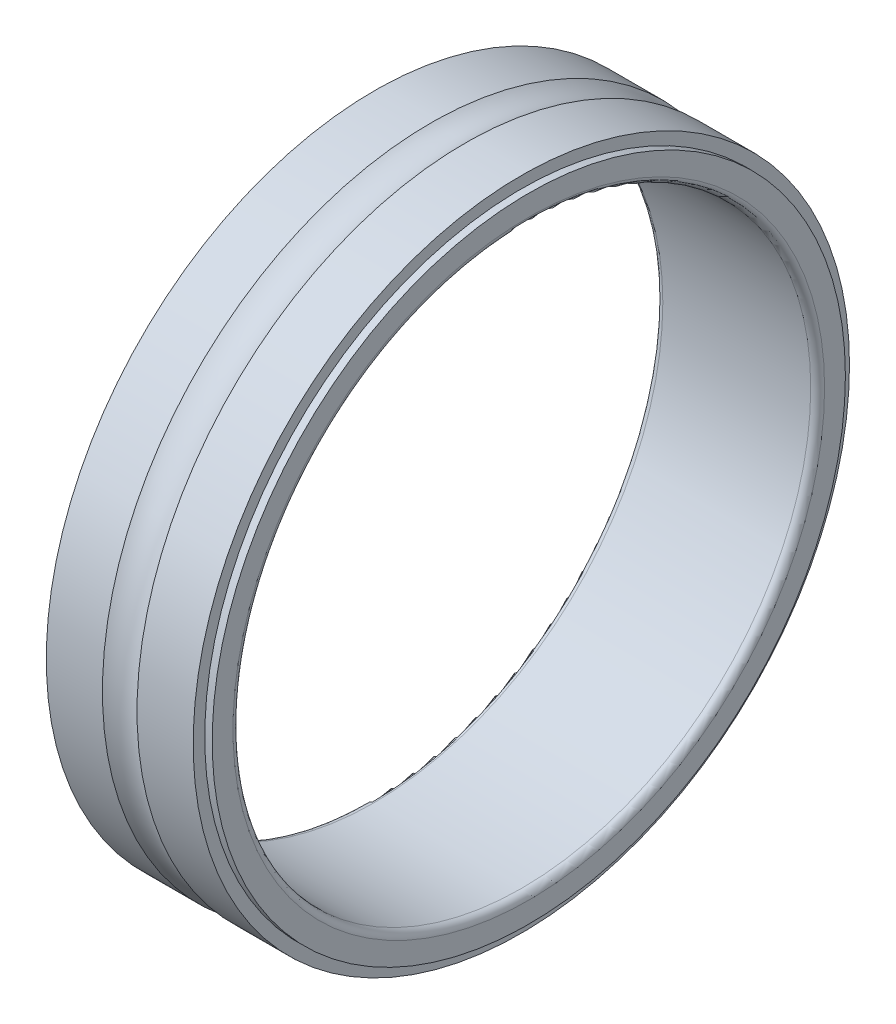
ISO-10303-21;
HEADER;
FILE_DESCRIPTION(('STEP AP214'),'2;1');
FILE_NAME('part.step','',(''),(''),'','','');
FILE_SCHEMA(('AUTOMOTIVE_DESIGN { 1 0 10303 214 1 1 1 1 }'));
ENDSEC;
DATA;
#1=APPLICATION_CONTEXT('core data for automotive mechanical design processes');
#2=APPLICATION_PROTOCOL_DEFINITION('international standard','automotive_design',2000,#1);
#3=PRODUCT_CONTEXT('',#1,'mechanical');
#4=PRODUCT('Part','Part','',(#3));
#5=PRODUCT_RELATED_PRODUCT_CATEGORY('part','',(#4));
#6=PRODUCT_DEFINITION_FORMATION('','',#4);
#7=PRODUCT_DEFINITION_CONTEXT('part definition',#1,'design');
#8=PRODUCT_DEFINITION('design','',#6,#7);
#9=PRODUCT_DEFINITION_SHAPE('','',#8);
#10=(LENGTH_UNIT() NAMED_UNIT(*) SI_UNIT(.MILLI.,.METRE.));
#11=(NAMED_UNIT(*) PLANE_ANGLE_UNIT() SI_UNIT($,.RADIAN.));
#12=(NAMED_UNIT(*) SI_UNIT($,.STERADIAN.) SOLID_ANGLE_UNIT());
#13=UNCERTAINTY_MEASURE_WITH_UNIT(LENGTH_MEASURE(1.E-05),#10,'distance_accuracy_value','');
#14=(GEOMETRIC_REPRESENTATION_CONTEXT(3) GLOBAL_UNCERTAINTY_ASSIGNED_CONTEXT((#13)) GLOBAL_UNIT_ASSIGNED_CONTEXT((#10,
#11,#12)) REPRESENTATION_CONTEXT('',''));
#15=CARTESIAN_POINT('',(0.,0.,0.));
#16=DIRECTION('',(0.,0.,1.));
#17=DIRECTION('',(1.,0.,0.));
#18=AXIS2_PLACEMENT_3D('',#15,#16,#17);
#19=CARTESIAN_POINT('',(7.,0.,0.));
#20=DIRECTION('',(1.,0.,0.));
#21=DIRECTION('',(0.,0.,-1.));
#22=AXIS2_PLACEMENT_3D('',#19,#20,#21);
#23=CYLINDRICAL_SURFACE('',#22,13.7);
#24=CARTESIAN_POINT('',(0.322,0.,0.));
#25=DIRECTION('',(1.,0.,0.));
#26=DIRECTION('',(0.,0.,-1.));
#27=AXIS2_PLACEMENT_3D('',#24,#25,#26);
#28=CIRCLE('',#27,13.7);
#29=CARTESIAN_POINT('',(0.322,0.,-13.7));
#30=VERTEX_POINT('',#29);
#31=EDGE_CURVE('E11',#30,#30,#28,.T.);
#32=ORIENTED_EDGE('',*,*,#31,.F.);
#33=EDGE_LOOP('',(#32));
#34=FACE_BOUND('',#33,.T.);
#35=CARTESIAN_POINT('',(0.,0.,0.));
#36=DIRECTION('',(1.,0.,0.));
#37=DIRECTION('',(0.,0.,-1.));
#38=AXIS2_PLACEMENT_3D('',#35,#36,#37);
#39=CIRCLE('',#38,13.7);
#40=CARTESIAN_POINT('',(0.,0.,-13.7));
#41=VERTEX_POINT('',#40);
#42=EDGE_CURVE('E82',#41,#41,#39,.T.);
#43=ORIENTED_EDGE('',*,*,#42,.T.);
#44=EDGE_LOOP('',(#43));
#45=FACE_BOUND('',#44,.T.);
#46=ADVANCED_FACE('F16',(#34,#45),#23,.T.);
#47=CARTESIAN_POINT('',(0.322,14.2,0.));
#48=DIRECTION('',(-1.,0.,0.));
#49=DIRECTION('',(0.,0.,1.));
#50=AXIS2_PLACEMENT_3D('',#47,#48,#49);
#51=PLANE('',#50);
#52=CARTESIAN_POINT('',(0.322,0.,0.));
#53=DIRECTION('',(1.,0.,0.));
#54=DIRECTION('',(0.,0.,-1.));
#55=AXIS2_PLACEMENT_3D('',#52,#53,#54);
#56=CIRCLE('',#55,14.2);
#57=CARTESIAN_POINT('',(0.322,0.,-14.2));
#58=VERTEX_POINT('',#57);
#59=EDGE_CURVE('E27',#58,#58,#56,.T.);
#60=ORIENTED_EDGE('',*,*,#59,.F.);
#61=EDGE_LOOP('',(#60));
#62=FACE_BOUND('',#61,.T.);
#63=ORIENTED_EDGE('',*,*,#31,.T.);
#64=EDGE_LOOP('',(#63));
#65=FACE_BOUND('',#64,.T.);
#66=ADVANCED_FACE('F206',(#62,#65),#51,.T.);
#67=CARTESIAN_POINT('',(7.,0.,0.));
#68=DIRECTION('',(1.,0.,0.));
#69=DIRECTION('',(0.,0.,-1.));
#70=AXIS2_PLACEMENT_3D('',#67,#68,#69);
#71=CYLINDRICAL_SURFACE('',#70,14.2);
#72=CARTESIAN_POINT('',(2.75166852264521,0.,0.));
#73=DIRECTION('',(1.,0.,0.));
#74=DIRECTION('',(0.,0.,-1.));
#75=AXIS2_PLACEMENT_3D('',#72,#73,#74);
#76=CIRCLE('',#75,14.2);
#77=CARTESIAN_POINT('',(2.75166852264521,0.,-14.2));
#78=VERTEX_POINT('',#77);
#79=EDGE_CURVE('E117',#78,#78,#76,.T.);
#80=ORIENTED_EDGE('',*,*,#79,.F.);
#81=EDGE_LOOP('',(#80));
#82=FACE_BOUND('',#81,.T.);
#83=ORIENTED_EDGE('',*,*,#59,.T.);
#84=EDGE_LOOP('',(#83));
#85=FACE_BOUND('',#84,.T.);
#86=ADVANCED_FACE('F183',(#82,#85),#71,.T.);
#87=CARTESIAN_POINT('',(3.5,0.,0.));
#88=DIRECTION('',(1.,0.,0.));
#89=DIRECTION('',(0.,0.,-1.));
#90=AXIS2_PLACEMENT_3D('',#87,#88,#89);
#91=TOROIDAL_SURFACE('',#90,15.5,1.5);
#92=ORIENTED_EDGE('',*,*,#79,.T.);
#93=EDGE_LOOP('',(#92));
#94=FACE_BOUND('',#93,.T.);
#95=CARTESIAN_POINT('',(4.24833147735479,0.,0.));
#96=DIRECTION('',(1.,0.,0.));
#97=DIRECTION('',(0.,0.,-1.));
#98=AXIS2_PLACEMENT_3D('',#95,#96,#97);
#99=CIRCLE('',#98,14.2);
#100=CARTESIAN_POINT('',(4.24833147735479,0.,-14.2));
#101=VERTEX_POINT('',#100);
#102=EDGE_CURVE('E48',#101,#101,#99,.T.);
#103=ORIENTED_EDGE('',*,*,#102,.F.);
#104=EDGE_LOOP('',(#103));
#105=FACE_BOUND('',#104,.T.);
#106=ADVANCED_FACE('F178',(#94,#105),#91,.F.);
#107=CARTESIAN_POINT('',(7.,0.,0.));
#108=DIRECTION('',(1.,0.,0.));
#109=DIRECTION('',(0.,0.,-1.));
#110=AXIS2_PLACEMENT_3D('',#107,#108,#109);
#111=CYLINDRICAL_SURFACE('',#110,14.2);
#112=CARTESIAN_POINT('',(6.678,0.,0.));
#113=DIRECTION('',(1.,0.,0.));
#114=DIRECTION('',(0.,0.,-1.));
#115=AXIS2_PLACEMENT_3D('',#112,#113,#114);
#116=CIRCLE('',#115,14.2);
#117=CARTESIAN_POINT('',(6.678,0.,-14.2));
#118=VERTEX_POINT('',#117);
#119=EDGE_CURVE('E59',#118,#118,#116,.T.);
#120=ORIENTED_EDGE('',*,*,#119,.F.);
#121=EDGE_LOOP('',(#120));
#122=FACE_BOUND('',#121,.T.);
#123=ORIENTED_EDGE('',*,*,#102,.T.);
#124=EDGE_LOOP('',(#123));
#125=FACE_BOUND('',#124,.T.);
#126=ADVANCED_FACE('F18',(#122,#125),#111,.T.);
#127=CARTESIAN_POINT('',(6.678,13.7,0.));
#128=DIRECTION('',(1.,0.,0.));
#129=DIRECTION('',(0.,1.,0.));
#130=AXIS2_PLACEMENT_3D('',#127,#128,#129);
#131=PLANE('',#130);
#132=CARTESIAN_POINT('',(6.678,0.,0.));
#133=DIRECTION('',(1.,0.,0.));
#134=DIRECTION('',(0.,0.,-1.));
#135=AXIS2_PLACEMENT_3D('',#132,#133,#134);
#136=CIRCLE('',#135,13.7);
#137=CARTESIAN_POINT('',(6.678,0.,-13.7));
#138=VERTEX_POINT('',#137);
#139=EDGE_CURVE('E20',#138,#138,#136,.T.);
#140=ORIENTED_EDGE('',*,*,#139,.F.);
#141=EDGE_LOOP('',(#140));
#142=FACE_BOUND('',#141,.T.);
#143=ORIENTED_EDGE('',*,*,#119,.T.);
#144=EDGE_LOOP('',(#143));
#145=FACE_BOUND('',#144,.T.);
#146=ADVANCED_FACE('F157',(#142,#145),#131,.T.);
#147=CARTESIAN_POINT('',(7.,0.,0.));
#148=DIRECTION('',(1.,0.,0.));
#149=DIRECTION('',(0.,0.,-1.));
#150=AXIS2_PLACEMENT_3D('',#147,#148,#149);
#151=CYLINDRICAL_SURFACE('',#150,13.7);
#152=CARTESIAN_POINT('',(7.,0.,0.));
#153=DIRECTION('',(1.,0.,0.));
#154=DIRECTION('',(0.,0.,-1.));
#155=AXIS2_PLACEMENT_3D('',#152,#153,#154);
#156=CIRCLE('',#155,13.7);
#157=CARTESIAN_POINT('',(7.,0.,-13.7));
#158=VERTEX_POINT('',#157);
#159=EDGE_CURVE('E100',#158,#158,#156,.T.);
#160=ORIENTED_EDGE('',*,*,#159,.F.);
#161=EDGE_LOOP('',(#160));
#162=FACE_BOUND('',#161,.T.);
#163=ORIENTED_EDGE('',*,*,#139,.T.);
#164=EDGE_LOOP('',(#163));
#165=FACE_BOUND('',#164,.T.);
#166=ADVANCED_FACE('F162',(#162,#165),#151,.T.);
#167=CARTESIAN_POINT('',(7.,12.8,0.));
#168=DIRECTION('',(1.,0.,0.));
#169=DIRECTION('',(0.,1.,0.));
#170=AXIS2_PLACEMENT_3D('',#167,#168,#169);
#171=PLANE('',#170);
#172=CARTESIAN_POINT('',(7.,0.,0.));
#173=DIRECTION('',(1.,0.,0.));
#174=DIRECTION('',(0.,0.,-1.));
#175=AXIS2_PLACEMENT_3D('',#172,#173,#174);
#176=CIRCLE('',#175,12.8);
#177=CARTESIAN_POINT('',(7.,0.,-12.8));
#178=VERTEX_POINT('',#177);
#179=EDGE_CURVE('E95',#178,#178,#176,.T.);
#180=ORIENTED_EDGE('',*,*,#179,.F.);
#181=EDGE_LOOP('',(#180));
#182=FACE_BOUND('',#181,.T.);
#183=ORIENTED_EDGE('',*,*,#159,.T.);
#184=EDGE_LOOP('',(#183));
#185=FACE_BOUND('',#184,.T.);
#186=ADVANCED_FACE('F101',(#182,#185),#171,.T.);
#187=CARTESIAN_POINT('',(6.7,0.,0.));
#188=DIRECTION('',(1.,0.,0.));
#189=DIRECTION('',(0.,0.,-1.));
#190=AXIS2_PLACEMENT_3D('',#187,#188,#189);
#191=TOROIDAL_SURFACE('',#190,12.8,0.3);
#192=CARTESIAN_POINT('',(6.7,0.,0.));
#193=DIRECTION('',(1.,0.,0.));
#194=DIRECTION('',(0.,0.,-1.));
#195=AXIS2_PLACEMENT_3D('',#192,#193,#194);
#196=CIRCLE('',#195,12.5);
#197=CARTESIAN_POINT('',(6.7,0.,-12.5));
#198=VERTEX_POINT('',#197);
#199=EDGE_CURVE('E110',#198,#198,#196,.T.);
#200=ORIENTED_EDGE('',*,*,#199,.F.);
#201=EDGE_LOOP('',(#200));
#202=FACE_BOUND('',#201,.T.);
#203=ORIENTED_EDGE('',*,*,#179,.T.);
#204=EDGE_LOOP('',(#203));
#205=FACE_BOUND('',#204,.T.);
#206=ADVANCED_FACE('F150',(#202,#205),#191,.T.);
#207=CARTESIAN_POINT('',(7.,0.,0.));
#208=DIRECTION('',(1.,0.,0.));
#209=DIRECTION('',(0.,0.,-1.));
#210=AXIS2_PLACEMENT_3D('',#207,#208,#209);
#211=CYLINDRICAL_SURFACE('',#210,12.5);
#212=CARTESIAN_POINT('',(0.3,0.,0.));
#213=DIRECTION('',(1.,0.,0.));
#214=DIRECTION('',(0.,0.,-1.));
#215=AXIS2_PLACEMENT_3D('',#212,#213,#214);
#216=CIRCLE('',#215,12.5);
#217=CARTESIAN_POINT('',(0.3,0.,-12.5));
#218=VERTEX_POINT('',#217);
#219=EDGE_CURVE('E116',#218,#218,#216,.T.);
#220=ORIENTED_EDGE('',*,*,#219,.F.);
#221=EDGE_LOOP('',(#220));
#222=FACE_BOUND('',#221,.T.);
#223=ORIENTED_EDGE('',*,*,#199,.T.);
#224=EDGE_LOOP('',(#223));
#225=FACE_BOUND('',#224,.T.);
#226=ADVANCED_FACE('F144',(#222,#225),#211,.F.);
#227=CARTESIAN_POINT('',(0.3,0.,0.));
#228=DIRECTION('',(1.,0.,0.));
#229=DIRECTION('',(0.,0.,-1.));
#230=AXIS2_PLACEMENT_3D('',#227,#228,#229);
#231=TOROIDAL_SURFACE('',#230,12.8,0.3);
#232=CARTESIAN_POINT('',(0.,0.,0.));
#233=DIRECTION('',(1.,0.,0.));
#234=DIRECTION('',(0.,0.,-1.));
#235=AXIS2_PLACEMENT_3D('',#232,#233,#234);
#236=CIRCLE('',#235,12.8);
#237=CARTESIAN_POINT('',(0.,0.,-12.8));
#238=VERTEX_POINT('',#237);
#239=EDGE_CURVE('E72',#238,#238,#236,.T.);
#240=ORIENTED_EDGE('',*,*,#239,.F.);
#241=EDGE_LOOP('',(#240));
#242=FACE_BOUND('',#241,.T.);
#243=ORIENTED_EDGE('',*,*,#219,.T.);
#244=EDGE_LOOP('',(#243));
#245=FACE_BOUND('',#244,.T.);
#246=ADVANCED_FACE('F149',(#242,#245),#231,.T.);
#247=CARTESIAN_POINT('',(0.,13.7,0.));
#248=DIRECTION('',(-1.,0.,0.));
#249=DIRECTION('',(0.,0.,1.));
#250=AXIS2_PLACEMENT_3D('',#247,#248,#249);
#251=PLANE('',#250);
#252=ORIENTED_EDGE('',*,*,#42,.F.);
#253=EDGE_LOOP('',(#252));
#254=FACE_BOUND('',#253,.T.);
#255=ORIENTED_EDGE('',*,*,#239,.T.);
#256=EDGE_LOOP('',(#255));
#257=FACE_BOUND('',#256,.T.);
#258=ADVANCED_FACE('F169',(#254,#257),#251,.T.);
#259=CLOSED_SHELL('',(#46,#66,#86,#106,#126,#146,#166,#186,#206,#226,#246,#258));
#260=MANIFOLD_SOLID_BREP('B1',#259);
#261=ADVANCED_BREP_SHAPE_REPRESENTATION('',(#18,#260),#14);
#262=SHAPE_DEFINITION_REPRESENTATION(#9,#261);
ENDSEC;
END-ISO-10303-21;
